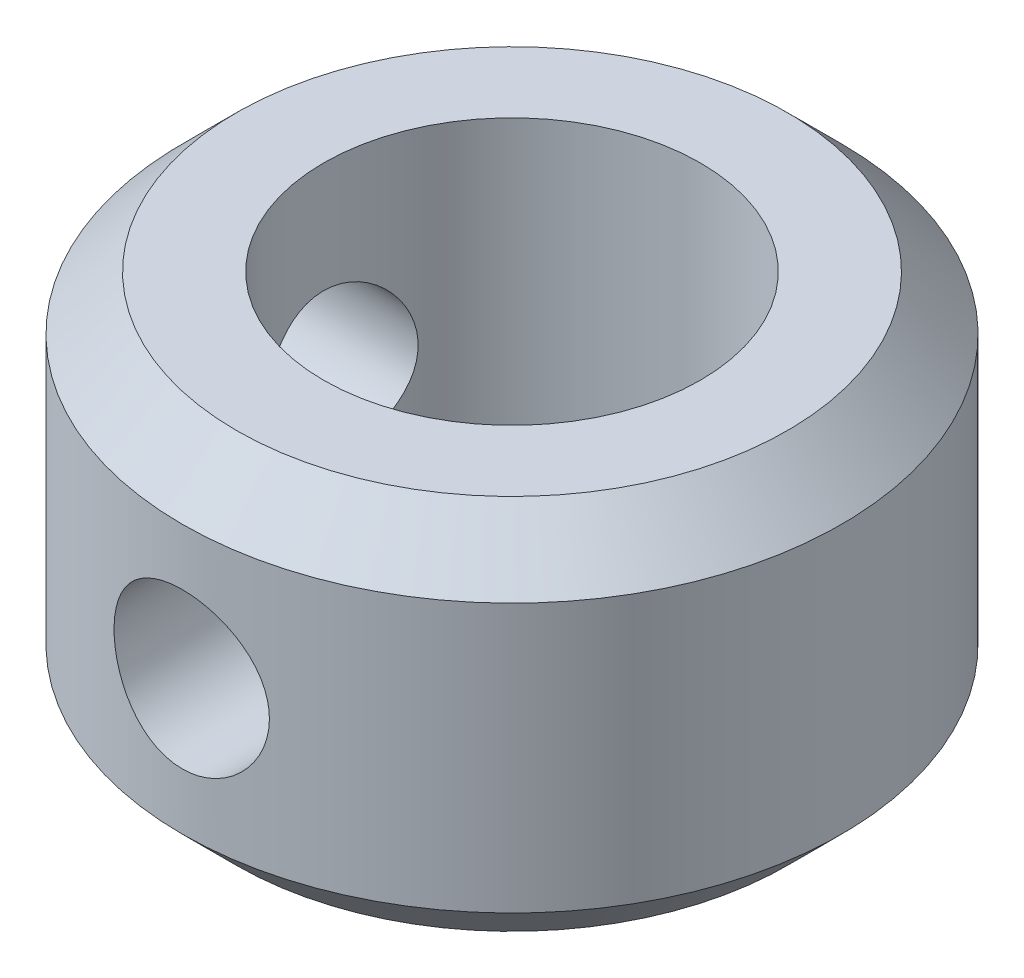
ISO-10303-21;
HEADER;
FILE_DESCRIPTION(('STEP AP214'),'2;1');
FILE_NAME('part.step','',(''),(''),'','','');
FILE_SCHEMA(('AUTOMOTIVE_DESIGN { 1 0 10303 214 1 1 1 1 }'));
ENDSEC;
DATA;
#1=APPLICATION_CONTEXT('core data for automotive mechanical design processes');
#2=APPLICATION_PROTOCOL_DEFINITION('international standard','automotive_design',2000,#1);
#3=PRODUCT_CONTEXT('',#1,'mechanical');
#4=PRODUCT('Part','Part','',(#3));
#5=PRODUCT_RELATED_PRODUCT_CATEGORY('part','',(#4));
#6=PRODUCT_DEFINITION_FORMATION('','',#4);
#7=PRODUCT_DEFINITION_CONTEXT('part definition',#1,'design');
#8=PRODUCT_DEFINITION('design','',#6,#7);
#9=PRODUCT_DEFINITION_SHAPE('','',#8);
#10=(LENGTH_UNIT() NAMED_UNIT(*) SI_UNIT(.MILLI.,.METRE.));
#11=(NAMED_UNIT(*) PLANE_ANGLE_UNIT() SI_UNIT($,.RADIAN.));
#12=(NAMED_UNIT(*) SI_UNIT($,.STERADIAN.) SOLID_ANGLE_UNIT());
#13=UNCERTAINTY_MEASURE_WITH_UNIT(LENGTH_MEASURE(1.E-05),#10,'distance_accuracy_value','');
#14=(GEOMETRIC_REPRESENTATION_CONTEXT(3) GLOBAL_UNCERTAINTY_ASSIGNED_CONTEXT((#13)) GLOBAL_UNIT_ASSIGNED_CONTEXT((#10,
#11,#12)) REPRESENTATION_CONTEXT('',''));
#15=CARTESIAN_POINT('',(0.,0.,0.));
#16=DIRECTION('',(0.,0.,1.));
#17=DIRECTION('',(1.,0.,0.));
#18=AXIS2_PLACEMENT_3D('',#15,#16,#17);
#19=CARTESIAN_POINT('',(0.,4.,0.));
#20=DIRECTION('',(0.,1.,0.));
#21=DIRECTION('',(0.,0.,1.));
#22=AXIS2_PLACEMENT_3D('',#19,#20,#21);
#23=PLANE('',#22);
#24=CARTESIAN_POINT('',(0.,4.,0.));
#25=DIRECTION('',(0.,1.,0.));
#26=DIRECTION('',(0.,0.,1.));
#27=AXIS2_PLACEMENT_3D('',#24,#25,#26);
#28=CIRCLE('',#27,5.85);
#29=CARTESIAN_POINT('',(0.,4.,5.85));
#30=VERTEX_POINT('',#29);
#31=EDGE_CURVE('E10',#30,#30,#28,.T.);
#32=ORIENTED_EDGE('',*,*,#31,.T.);
#33=EDGE_LOOP('',(#32));
#34=FACE_BOUND('',#33,.T.);
#35=CARTESIAN_POINT('',(0.,4.,0.));
#36=DIRECTION('',(0.,1.,0.));
#37=DIRECTION('',(0.,0.,1.));
#38=AXIS2_PLACEMENT_3D('',#35,#36,#37);
#39=CIRCLE('',#38,4.);
#40=CARTESIAN_POINT('',(0.,4.,4.));
#41=VERTEX_POINT('',#40);
#42=EDGE_CURVE('E68',#41,#41,#39,.T.);
#43=ORIENTED_EDGE('',*,*,#42,.F.);
#44=EDGE_LOOP('',(#43));
#45=FACE_BOUND('',#44,.T.);
#46=ADVANCED_FACE('F47',(#34,#45),#23,.T.);
#47=CARTESIAN_POINT('',(0.,-4.,0.));
#48=DIRECTION('',(0.,1.,0.));
#49=DIRECTION('',(0.,0.,1.));
#50=AXIS2_PLACEMENT_3D('',#47,#48,#49);
#51=PLANE('',#50);
#52=CARTESIAN_POINT('',(0.,-4.,0.));
#53=DIRECTION('',(0.,1.,0.));
#54=DIRECTION('',(0.,0.,1.));
#55=AXIS2_PLACEMENT_3D('',#52,#53,#54);
#56=CIRCLE('',#55,5.84999999999999);
#57=CARTESIAN_POINT('',(0.,-4.,5.84999999999999));
#58=VERTEX_POINT('',#57);
#59=EDGE_CURVE('E55',#58,#58,#56,.F.);
#60=ORIENTED_EDGE('',*,*,#59,.T.);
#61=EDGE_LOOP('',(#60));
#62=FACE_BOUND('',#61,.T.);
#63=CARTESIAN_POINT('',(0.,-4.,0.));
#64=DIRECTION('',(0.,1.,0.));
#65=DIRECTION('',(0.,0.,1.));
#66=AXIS2_PLACEMENT_3D('',#63,#64,#65);
#67=CIRCLE('',#66,4.);
#68=CARTESIAN_POINT('',(0.,-4.,4.));
#69=VERTEX_POINT('',#68);
#70=EDGE_CURVE('E69',#69,#69,#67,.T.);
#71=ORIENTED_EDGE('',*,*,#70,.T.);
#72=EDGE_LOOP('',(#71));
#73=FACE_BOUND('',#72,.T.);
#74=ADVANCED_FACE('F107',(#62,#73),#51,.F.);
#75=CARTESIAN_POINT('',(0.,4.,0.));
#76=DIRECTION('',(0.,-1.,0.));
#77=DIRECTION('',(0.,0.,-1.));
#78=AXIS2_PLACEMENT_3D('',#75,#76,#77);
#79=CYLINDRICAL_SURFACE('',#78,7.);
#80=CARTESIAN_POINT('',(-6.80275679412399,0.,1.64999999999998));
#81=CARTESIAN_POINT('',(-6.80275861136206,-0.0912890000234779,1.64999713007314));
#82=CARTESIAN_POINT('',(-6.80461440498174,-0.182610998381094,1.64239813439993));
#83=CARTESIAN_POINT('',(-6.81182064992734,-0.362644563434028,1.61224414767595));
#84=CARTESIAN_POINT('',(-6.81717336620826,-0.451354399288549,1.58967946321203));
#85=CARTESIAN_POINT('',(-6.83073431325552,-0.623533512523368,1.53035515036091));
#86=CARTESIAN_POINT('',(-6.83893911932178,-0.707008933959494,1.49361254058447));
#87=CARTESIAN_POINT('',(-6.85727558075245,-0.866616532790047,1.40702581854955));
#88=CARTESIAN_POINT('',(-6.86740726130098,-0.942748614187931,1.35718153504988));
#89=CARTESIAN_POINT('',(-6.88867782513988,-1.08699982868594,1.24476461908349));
#90=CARTESIAN_POINT('',(-6.89983131541128,-1.15495404527719,1.18198309355865));
#91=CARTESIAN_POINT('',(-6.92176152937785,-1.27947171170117,1.04592427298926));
#92=CARTESIAN_POINT('',(-6.93253822068664,-1.33603418437752,0.972646078487472));
#93=CARTESIAN_POINT('',(-6.95266103704035,-1.43682696981727,0.816555491676971));
#94=CARTESIAN_POINT('',(-6.96198791366554,-1.48089686123284,0.73363681447964));
#95=CARTESIAN_POINT('',(-6.97799434603916,-1.55441290827776,0.561312838562611));
#96=CARTESIAN_POINT('',(-6.98467424785277,-1.58386097569016,0.471908389601348));
#97=CARTESIAN_POINT('',(-6.99453084372035,-1.62677370217112,0.29086802205239));
#98=CARTESIAN_POINT('',(-6.99776875317269,-1.64051799396695,0.199301775715435));
#99=CARTESIAN_POINT('',(-7.00058928212562,-1.65250913676126,0.015109783907853));
#100=CARTESIAN_POINT('',(-7.00017238432294,-1.65075803426303,-0.0775158200378599));
#101=CARTESIAN_POINT('',(-6.99577641572093,-1.63201259498984,-0.259263367840057));
#102=CARTESIAN_POINT('',(-6.99186783471482,-1.61531988499546,-0.348418380319093));
#103=CARTESIAN_POINT('',(-6.98100889430398,-1.56764792556426,-0.522624624983785));
#104=CARTESIAN_POINT('',(-6.97405838372646,-1.53666796609913,-0.607675652983124));
#105=CARTESIAN_POINT('',(-6.95778608866946,-1.46104622960672,-0.772074386794576));
#106=CARTESIAN_POINT('',(-6.94844521053821,-1.41629382953033,-0.851369239725069));
#107=CARTESIAN_POINT('',(-6.92841069918987,-1.31448077411501,-1.00143136070303));
#108=CARTESIAN_POINT('',(-6.91771685448099,-1.25741819349895,-1.07219729215005));
#109=CARTESIAN_POINT('',(-6.89584251761334,-1.13097547490599,-1.20498965605835));
#110=CARTESIAN_POINT('',(-6.88465650871199,-1.06133150430551,-1.26676421005728));
#111=CARTESIAN_POINT('',(-6.8632971795881,-0.912555678850197,-1.37780936391996));
#112=CARTESIAN_POINT('',(-6.85312389657327,-0.83342347563159,-1.42707950447268));
#113=CARTESIAN_POINT('',(-6.83492437266262,-0.667464740192945,-1.51185477157776));
#114=CARTESIAN_POINT('',(-6.82690665922474,-0.580609406049146,-1.54730546989211));
#115=CARTESIAN_POINT('',(-6.8140390867396,-0.40193872243084,-1.60302771512783));
#116=CARTESIAN_POINT('',(-6.80918863409246,-0.31012430586923,-1.62330210645791));
#117=CARTESIAN_POINT('',(-6.80332774943588,-0.12646144305076,-1.64769127898041));
#118=CARTESIAN_POINT('',(-6.80222947433875,-0.0346648402699374,-1.65217579860459));
#119=CARTESIAN_POINT('',(-6.80375919481422,0.148364576583741,-1.64586488795027));
#120=CARTESIAN_POINT('',(-6.80638688917232,0.239597435631894,-1.63507069283236));
#121=CARTESIAN_POINT('',(-6.81498886694796,0.417577450747468,-1.59883140460814));
#122=CARTESIAN_POINT('',(-6.82091521063604,0.504369845653747,-1.5735960425171));
#123=CARTESIAN_POINT('',(-6.83540229380027,0.672493686634514,-1.50942069873875));
#124=CARTESIAN_POINT('',(-6.84396331787599,0.753824541593779,-1.47047923644587));
#125=CARTESIAN_POINT('',(-6.86294389007105,0.910299056589382,-1.37920410959567));
#126=CARTESIAN_POINT('',(-6.87339357272798,0.985308184742531,-1.32664621508519));
#127=CARTESIAN_POINT('',(-6.89489755256542,1.12557800629822,-1.20991829013256));
#128=CARTESIAN_POINT('',(-6.90595193742742,1.19083728083161,-1.14574657256201));
#129=CARTESIAN_POINT('',(-6.92771364919943,1.31122298204255,-1.00592681617984));
#130=CARTESIAN_POINT('',(-6.93840801965821,1.36609535547159,-0.930057660220554));
#131=CARTESIAN_POINT('',(-6.95799159344944,1.46231801677791,-0.769965220758971));
#132=CARTESIAN_POINT('',(-6.96688088727282,1.50366898256505,-0.685742356354583));
#133=CARTESIAN_POINT('',(-6.98179887024889,1.57133783893331,-0.511894272134583));
#134=CARTESIAN_POINT('',(-6.98784709878863,1.59775867456761,-0.422310877248057));
#135=CARTESIAN_POINT('',(-6.99648655479454,1.63513286894146,-0.239816201973873));
#136=CARTESIAN_POINT('',(-6.99907837091255,1.64608886147333,-0.146905491020391));
#137=CARTESIAN_POINT('',(-7.00049202890772,1.65208813057133,0.0372082467747126));
#138=CARTESIAN_POINT('',(-6.9994031706394,1.64750832426096,0.128398504210663));
#139=CARTESIAN_POINT('',(-6.99377268350157,1.62341975270527,0.308670729816493));
#140=CARTESIAN_POINT('',(-6.98923113721447,1.60391134452658,0.397752748359306));
#141=CARTESIAN_POINT('',(-6.97721604451342,1.55071176108928,0.570933576895618));
#142=CARTESIAN_POINT('',(-6.96975517685192,1.51708187051132,0.655052149359122));
#143=CARTESIAN_POINT('',(-6.95269208722048,1.4366509910792,0.816498795364736));
#144=CARTESIAN_POINT('',(-6.94308962308136,1.38984851252764,0.893826099578973));
#145=CARTESIAN_POINT('',(-6.92252474173611,1.28321390355334,1.0413072599721));
#146=CARTESIAN_POINT('',(-6.91153737485731,1.22312153020512,1.11126948147332));
#147=CARTESIAN_POINT('',(-6.88956325338245,1.09212760248887,1.24024523339419));
#148=CARTESIAN_POINT('',(-6.8785764996075,1.02122338274089,1.29925605605593));
#149=CARTESIAN_POINT('',(-6.85764827463158,0.869245406144731,1.40557849643648));
#150=CARTESIAN_POINT('',(-6.84772646444862,0.788026388521302,1.4526866153972));
#151=CARTESIAN_POINT('',(-6.83030721412674,0.618602666246867,1.53250931126196));
#152=CARTESIAN_POINT('',(-6.8228078728753,0.530403507505555,1.56523518241756));
#153=CARTESIAN_POINT('',(-6.81235745600282,0.368530845590517,1.61002842680634));
#154=CARTESIAN_POINT('',(-6.80878274857868,0.295683995155681,1.62498700416514));
#155=CARTESIAN_POINT('',(-6.80398175593831,0.148565318467718,1.64497362976396));
#156=CARTESIAN_POINT('',(-6.80275531520392,0.0742935869089511,1.65000233562813));
#157=CARTESIAN_POINT('',(-6.80275679412399,0.,1.64999999999998));
#158=B_SPLINE_CURVE_WITH_KNOTS('',3,(#80,#81,#82,#83,#84,#85,#86,#87,#88,#89,#90,#91,#92,#93,
#94,#95,#96,#97,#98,#99,#100,#101,#102,#103,#104,#105,#106,#107,#108,#109,#110,#111,#112,#113,
#114,#115,#116,#117,#118,#119,#120,#121,#122,#123,#124,#125,#126,#127,#128,#129,#130,#131,#132,
#133,#134,#135,#136,#137,#138,#139,#140,#141,#142,#143,#144,#145,#146,#147,#148,#149,#150,#151,
#152,#153,#154,#155,#156,#157),.UNSPECIFIED.,.T.,.F.,(4,2,2,2,2,2,2,2,2,2,2,2,2,2,2,2,2,2,2,2,2,
2,2,2,2,2,2,2,2,2,2,2,2,2,2,2,2,2,4),(0.,0.273594440399258,0.547366263700774,0.820810479503744,
1.0942582694491,1.37252656286893,1.65081871531698,1.93253747960749,2.21421939985748,
2.49080324523182,2.76735056224876,3.03843805884697,3.30953902903524,3.5828770280852,
3.85625780745004,4.13623055025586,4.41621357550839,4.69728844125184,4.97831061353603,
5.25270687968443,5.52708096437946,5.79756789407088,6.06808405216623,6.34337456664896,
6.61870510445458,6.90008328124663,7.18144734868653,7.46084693391317,7.74019892930651,
8.01282246332762,8.28543947686365,8.55688541369867,8.82836206089266,9.10571835709369,
9.38314313916058,9.66503130549495,9.9466977102697,10.1693714016501,10.3920303455577),.UNSPECIFIED.);
#159=CARTESIAN_POINT('',(-6.80275679412399,0.,1.64999999999998));
#160=VERTEX_POINT('',#159);
#161=EDGE_CURVE('E123',#160,#160,#158,.T.);
#162=ORIENTED_EDGE('',*,*,#161,.T.);
#163=EDGE_LOOP('',(#162));
#164=FACE_BOUND('',#163,.T.);
#165=CARTESIAN_POINT('',(0.,-2.85,0.));
#166=DIRECTION('',(0.,1.,0.));
#167=DIRECTION('',(0.,0.,1.));
#168=AXIS2_PLACEMENT_3D('',#165,#166,#167);
#169=CIRCLE('',#168,7.);
#170=CARTESIAN_POINT('',(0.,-2.85,7.));
#171=VERTEX_POINT('',#170);
#172=EDGE_CURVE('E59',#171,#171,#169,.T.);
#173=ORIENTED_EDGE('',*,*,#172,.T.);
#174=EDGE_LOOP('',(#173));
#175=FACE_BOUND('',#174,.T.);
#176=CARTESIAN_POINT('',(0.,2.85,0.));
#177=DIRECTION('',(0.,1.,0.));
#178=DIRECTION('',(0.,0.,1.));
#179=AXIS2_PLACEMENT_3D('',#176,#177,#178);
#180=CIRCLE('',#179,7.);
#181=CARTESIAN_POINT('',(0.,2.85,7.));
#182=VERTEX_POINT('',#181);
#183=EDGE_CURVE('E63',#182,#182,#180,.F.);
#184=ORIENTED_EDGE('',*,*,#183,.T.);
#185=EDGE_LOOP('',(#184));
#186=FACE_BOUND('',#185,.T.);
#187=CARTESIAN_POINT('',(1.65,0.,6.80275679412398));
#188=CARTESIAN_POINT('',(1.64999713007316,-0.0912890000234778,6.80275861136205));
#189=CARTESIAN_POINT('',(1.64239813439995,-0.182610998381094,6.80461440498174));
#190=CARTESIAN_POINT('',(1.61224414767597,-0.362644563434028,6.81182064992733));
#191=CARTESIAN_POINT('',(1.58967946321205,-0.451354399288548,6.81717336620826));
#192=CARTESIAN_POINT('',(1.53035515036094,-0.623533512523368,6.83073431325551));
#193=CARTESIAN_POINT('',(1.49361254058449,-0.707008933959494,6.83893911932177));
#194=CARTESIAN_POINT('',(1.40702581854958,-0.866616532790047,6.85727558075245));
#195=CARTESIAN_POINT('',(1.3571815350499,-0.94274861418793,6.86740726130097));
#196=CARTESIAN_POINT('',(1.24476461908352,-1.08699982868594,6.88867782513987));
#197=CARTESIAN_POINT('',(1.18198309355868,-1.15495404527719,6.89983131541127));
#198=CARTESIAN_POINT('',(1.04592427298928,-1.27947171170116,6.92176152937784));
#199=CARTESIAN_POINT('',(0.972646078487497,-1.33603418437752,6.93253822068664));
#200=CARTESIAN_POINT('',(0.816555491676995,-1.43682696981727,6.95266103704034));
#201=CARTESIAN_POINT('',(0.733636814479665,-1.48089686123284,6.96198791366554));
#202=CARTESIAN_POINT('',(0.561312838562636,-1.55441290827776,6.97799434603916));
#203=CARTESIAN_POINT('',(0.471908389601373,-1.58386097569016,6.98467424785277));
#204=CARTESIAN_POINT('',(0.290868022052415,-1.62677370217112,6.99453084372035));
#205=CARTESIAN_POINT('',(0.199301775715461,-1.64051799396695,6.99776875317269));
#206=CARTESIAN_POINT('',(0.0151097839078784,-1.65250913676126,7.00058928212562));
#207=CARTESIAN_POINT('',(-0.0775158200378344,-1.65075803426303,7.00017238432294));
#208=CARTESIAN_POINT('',(-0.259263367840032,-1.63201259498984,6.99577641572093));
#209=CARTESIAN_POINT('',(-0.348418380319068,-1.61531988499546,6.99186783471482));
#210=CARTESIAN_POINT('',(-0.52262462498376,-1.56764792556427,6.98100889430398));
#211=CARTESIAN_POINT('',(-0.607675652983099,-1.53666796609913,6.97405838372646));
#212=CARTESIAN_POINT('',(-0.77207438679455,-1.46104622960672,6.95778608866946));
#213=CARTESIAN_POINT('',(-0.851369239725044,-1.41629382953033,6.94844521053821));
#214=CARTESIAN_POINT('',(-1.00143136070301,-1.31448077411501,6.92841069918987));
#215=CARTESIAN_POINT('',(-1.07219729215003,-1.25741819349895,6.91771685448099));
#216=CARTESIAN_POINT('',(-1.20498965605832,-1.13097547490599,6.89584251761335));
#217=CARTESIAN_POINT('',(-1.26676421005725,-1.06133150430551,6.88465650871199));
#218=CARTESIAN_POINT('',(-1.37780936391993,-0.912555678850199,6.8632971795881));
#219=CARTESIAN_POINT('',(-1.42707950447265,-0.833423475631591,6.85312389657327));
#220=CARTESIAN_POINT('',(-1.51185477157774,-0.667464740192947,6.83492437266263));
#221=CARTESIAN_POINT('',(-1.54730546989208,-0.580609406049148,6.82690665922475));
#222=CARTESIAN_POINT('',(-1.6030277151278,-0.401938722430842,6.8140390867396));
#223=CARTESIAN_POINT('',(-1.62330210645788,-0.310124305869232,6.80918863409247));
#224=CARTESIAN_POINT('',(-1.64769127898038,-0.126461443050763,6.80332774943589));
#225=CARTESIAN_POINT('',(-1.65217579860456,-0.0346648402699397,6.80222947433876));
#226=CARTESIAN_POINT('',(-1.64586488795024,0.148364576583739,6.80375919481422));
#227=CARTESIAN_POINT('',(-1.63507069283233,0.239597435631891,6.80638688917233));
#228=CARTESIAN_POINT('',(-1.59883140460811,0.417577450747466,6.81498886694796));
#229=CARTESIAN_POINT('',(-1.57359604251707,0.504369845653746,6.82091521063605));
#230=CARTESIAN_POINT('',(-1.50942069873872,0.672493686634512,6.83540229380027));
#231=CARTESIAN_POINT('',(-1.47047923644584,0.753824541593777,6.84396331787599));
#232=CARTESIAN_POINT('',(-1.37920410959564,0.91029905658938,6.86294389007106));
#233=CARTESIAN_POINT('',(-1.32664621508517,0.98530818474253,6.87339357272798));
#234=CARTESIAN_POINT('',(-1.20991829013253,1.12557800629822,6.89489755256543));
#235=CARTESIAN_POINT('',(-1.14574657256199,1.19083728083161,6.90595193742742));
#236=CARTESIAN_POINT('',(-1.00592681617982,1.31122298204255,6.92771364919943));
#237=CARTESIAN_POINT('',(-0.930057660220531,1.36609535547159,6.93840801965821));
#238=CARTESIAN_POINT('',(-0.769965220758949,1.4623180167779,6.95799159344945));
#239=CARTESIAN_POINT('',(-0.68574235635456,1.50366898256505,6.96688088727282));
#240=CARTESIAN_POINT('',(-0.511894272134561,1.57133783893331,6.98179887024889));
#241=CARTESIAN_POINT('',(-0.422310877248035,1.59775867456761,6.98784709878863));
#242=CARTESIAN_POINT('',(-0.239816201973852,1.63513286894146,6.99648655479454));
#243=CARTESIAN_POINT('',(-0.146905491020369,1.64608886147333,6.99907837091255));
#244=CARTESIAN_POINT('',(0.0372082467747346,1.65208813057133,7.00049202890772));
#245=CARTESIAN_POINT('',(0.128398504210685,1.64750832426096,6.9994031706394));
#246=CARTESIAN_POINT('',(0.308670729816515,1.62341975270527,6.99377268350157));
#247=CARTESIAN_POINT('',(0.397752748359328,1.60391134452658,6.98923113721447));
#248=CARTESIAN_POINT('',(0.57093357689564,1.55071176108928,6.97721604451341));
#249=CARTESIAN_POINT('',(0.655052149359144,1.51708187051132,6.96975517685192));
#250=CARTESIAN_POINT('',(0.816498795364758,1.4366509910792,6.95269208722048));
#251=CARTESIAN_POINT('',(0.893826099578996,1.38984851252764,6.94308962308136));
#252=CARTESIAN_POINT('',(1.04130725997212,1.28321390355334,6.92252474173611));
#253=CARTESIAN_POINT('',(1.11126948147334,1.22312153020512,6.91153737485731));
#254=CARTESIAN_POINT('',(1.24024523339421,1.09212760248887,6.88956325338245));
#255=CARTESIAN_POINT('',(1.29925605605595,1.02122338274089,6.87857649960749));
#256=CARTESIAN_POINT('',(1.40557849643651,0.869245406144734,6.85764827463158));
#257=CARTESIAN_POINT('',(1.45268661539722,0.788026388521305,6.84772646444862));
#258=CARTESIAN_POINT('',(1.53250931126199,0.61860266624687,6.83030721412674));
#259=CARTESIAN_POINT('',(1.56523518241758,0.530403507505558,6.82280787287529));
#260=CARTESIAN_POINT('',(1.61002842680637,0.36853084559052,6.81235745600281));
#261=CARTESIAN_POINT('',(1.62498700416516,0.295683995155683,6.80878274857867));
#262=CARTESIAN_POINT('',(1.64497362976398,0.148565318467719,6.8039817559383));
#263=CARTESIAN_POINT('',(1.65000233562816,0.0742935869089515,6.80275531520391));
#264=CARTESIAN_POINT('',(1.65,0.,6.80275679412398));
#265=B_SPLINE_CURVE_WITH_KNOTS('',3,(#187,#188,#189,#190,#191,#192,#193,#194,#195,#196,#197,
#198,#199,#200,#201,#202,#203,#204,#205,#206,#207,#208,#209,#210,#211,#212,#213,#214,#215,#216,
#217,#218,#219,#220,#221,#222,#223,#224,#225,#226,#227,#228,#229,#230,#231,#232,#233,#234,#235,
#236,#237,#238,#239,#240,#241,#242,#243,#244,#245,#246,#247,#248,#249,#250,#251,#252,#253,#254,
#255,#256,#257,#258,#259,#260,#261,#262,#263,#264),.UNSPECIFIED.,.T.,.F.,(4,2,2,2,2,2,2,2,2,2,2,
2,2,2,2,2,2,2,2,2,2,2,2,2,2,2,2,2,2,2,2,2,2,2,2,2,2,2,4),(0.,0.273594440399257,
0.547366263700773,0.820810479503744,1.0942582694491,1.37252656286893,1.65081871531698,
1.93253747960749,2.21421939985748,2.49080324523182,2.76735056224876,3.03843805884696,
3.30953902903524,3.5828770280852,3.85625780745004,4.13623055025586,4.41621357550839,
4.69728844125184,4.97831061353603,5.25270687968443,5.52708096437946,5.79756789407088,
6.06808405216623,6.34337456664896,6.61870510445458,6.90008328124663,7.18144734868653,
7.46084693391317,7.74019892930651,8.01282246332762,8.28543947686366,8.55688541369867,
8.82836206089266,9.10571835709369,9.38314313916058,9.66503130549495,9.9466977102697,
10.1693714016501,10.3920303455577),.UNSPECIFIED.);
#266=CARTESIAN_POINT('',(1.65,0.,6.80275679412398));
#267=VERTEX_POINT('',#266);
#268=EDGE_CURVE('E72',#267,#267,#265,.T.);
#269=ORIENTED_EDGE('',*,*,#268,.T.);
#270=EDGE_LOOP('',(#269));
#271=FACE_BOUND('',#270,.T.);
#272=ADVANCED_FACE('F88',(#164,#175,#186,#271),#79,.T.);
#273=CARTESIAN_POINT('',(0.,4.,0.));
#274=DIRECTION('',(0.,-1.,0.));
#275=DIRECTION('',(0.,0.,-1.));
#276=AXIS2_PLACEMENT_3D('',#273,#274,#275);
#277=CYLINDRICAL_SURFACE('',#276,4.);
#278=CARTESIAN_POINT('',(-3.64383040220042,0.,1.64999999999999));
#279=CARTESIAN_POINT('',(-3.64383945275153,-0.0880964802256836,1.64999056813101));
#280=CARTESIAN_POINT('',(-3.64707173267574,-0.176340431973594,1.64289989177357));
#281=CARTESIAN_POINT('',(-3.65959209124688,-0.35028706107888,1.61480845546372));
#282=CARTESIAN_POINT('',(-3.66889676295875,-0.435982100597603,1.59376957896339));
#283=CARTESIAN_POINT('',(-3.69231325052126,-0.602002938130633,1.53873536249637));
#284=CARTESIAN_POINT('',(-3.70640571161012,-0.682348820218598,1.50479212400172));
#285=CARTESIAN_POINT('',(-3.73778230052357,-0.836181766834224,1.42506535594205));
#286=CARTESIAN_POINT('',(-3.75506562873473,-0.909670542784035,1.37928479159594));
#287=CARTESIAN_POINT('',(-3.79205530418551,-1.0522286878465,1.2741985629037));
#288=CARTESIAN_POINT('',(-3.8118427770478,-1.12082925578021,1.21428518241358));
#289=CARTESIAN_POINT('',(-3.85094363418238,-1.24735477190876,1.08391072165481));
#290=CARTESIAN_POINT('',(-3.87025683535297,-1.30527565147222,1.01344563996363));
#291=CARTESIAN_POINT('',(-3.90721575035943,-1.41117137130186,0.860301943593368));
#292=CARTESIAN_POINT('',(-3.92475616703248,-1.45862093270616,0.777232390113576));
#293=CARTESIAN_POINT('',(-3.95520283117798,-1.5386701453217,0.603436361875843));
#294=CARTESIAN_POINT('',(-3.96811109652272,-1.57127626434656,0.512713242513031));
#295=CARTESIAN_POINT('',(-3.98726403378776,-1.61902070665623,0.331105172304384));
#296=CARTESIAN_POINT('',(-3.99381564337609,-1.63496684792323,0.240465625184478));
#297=CARTESIAN_POINT('',(-4.0006306156112,-1.65154665185517,0.0575763551498512));
#298=CARTESIAN_POINT('',(-4.00089647540932,-1.65218639532201,-0.0346727137709691));
#299=CARTESIAN_POINT('',(-3.99529224160632,-1.63856350386341,-0.212297380895999));
#300=CARTESIAN_POINT('',(-3.98978733384658,-1.6251878162829,-0.297754665400411));
#301=CARTESIAN_POINT('',(-3.97375926025944,-1.58543118255224,-0.465085845235293));
#302=CARTESIAN_POINT('',(-3.96323572489496,-1.55904927870932,-0.546959476205506));
#303=CARTESIAN_POINT('',(-3.93798907731602,-1.49371233827982,-0.706295606817243));
#304=CARTESIAN_POINT('',(-3.92320447216362,-1.45457201007513,-0.783671979762483));
#305=CARTESIAN_POINT('',(-3.89088763760773,-1.3650087208134,-0.930960489992479));
#306=CARTESIAN_POINT('',(-3.87335444442336,-1.3145817994967,-1.00086999453933));
#307=CARTESIAN_POINT('',(-3.83587133640027,-1.19981176097137,-1.13638530947042));
#308=CARTESIAN_POINT('',(-3.8158381454309,-1.13474658910128,-1.20135746318646));
#309=CARTESIAN_POINT('',(-3.77653142784555,-0.994590333678428,-1.31973838423495));
#310=CARTESIAN_POINT('',(-3.75725818494772,-0.919495550736701,-1.37314286572203));
#311=CARTESIAN_POINT('',(-3.72106607156909,-0.758401596452687,-1.46845339844829));
#312=CARTESIAN_POINT('',(-3.70424107982557,-0.672132428307352,-1.50994179309278));
#313=CARTESIAN_POINT('',(-3.67596385006485,-0.492953328594107,-1.57754508127097));
#314=CARTESIAN_POINT('',(-3.66450786071417,-0.400048086126187,-1.60367071206122));
#315=CARTESIAN_POINT('',(-3.64919091711418,-0.216577104815017,-1.63821320355943));
#316=CARTESIAN_POINT('',(-3.64489111171831,-0.126241698817143,-1.64765569454683));
#317=CARTESIAN_POINT('',(-3.64311980380967,0.0548056296985959,-1.65157101672828));
#318=CARTESIAN_POINT('',(-3.64564601607449,0.145517416059281,-1.64604885780403));
#319=CARTESIAN_POINT('',(-3.6567894436616,0.31880100904947,-1.62112710501828));
#320=CARTESIAN_POINT('',(-3.66501803861664,0.401528179674606,-1.60261202118544));
#321=CARTESIAN_POINT('',(-3.68614612916707,0.56263706437997,-1.55339580262016));
#322=CARTESIAN_POINT('',(-3.69904670212356,0.641017771351657,-1.52269185697124));
#323=CARTESIAN_POINT('',(-3.72872477858182,0.794879005695636,-1.44853902204986));
#324=CARTESIAN_POINT('',(-3.74564214050945,0.870100194779244,-1.40460979308265));
#325=CARTESIAN_POINT('',(-3.78124523189863,1.01246016942973,-1.30573455409453));
#326=CARTESIAN_POINT('',(-3.79993171387674,1.07959548773512,-1.25078384473685));
#327=CARTESIAN_POINT('',(-3.83876011670653,1.20942962644671,-1.126275421621));
#328=CARTESIAN_POINT('',(-3.85889967217622,1.27135173704872,-1.05590387126705));
#329=CARTESIAN_POINT('',(-3.89698114804694,1.38264285566206,-0.905297980080119));
#330=CARTESIAN_POINT('',(-3.91492292631236,1.4320110520032,-0.825063002026919));
#331=CARTESIAN_POINT('',(-3.94668767391886,1.51670413420679,-0.656516816883283));
#332=CARTESIAN_POINT('',(-3.96050313975063,1.55200347500273,-0.568191273870507));
#333=CARTESIAN_POINT('',(-3.98237104121021,1.60699165685874,-0.386140833605193));
#334=CARTESIAN_POINT('',(-3.9904268305481,1.62668958293894,-0.292419112817577));
#335=CARTESIAN_POINT('',(-3.9994889299446,1.64878822892048,-0.109187189544852));
#336=CARTESIAN_POINT('',(-4.00094173424749,1.65228482874194,-0.0198303081186516));
#337=CARTESIAN_POINT('',(-3.99786220239439,1.64481456562972,0.158161739195396));
#338=CARTESIAN_POINT('',(-3.99333087896147,1.63385015000455,0.246797024648464));
#339=CARTESIAN_POINT('',(-3.979024148364,1.59855535786444,0.41770537593586));
#340=CARTESIAN_POINT('',(-3.96943363922013,1.57469555788545,0.500092371627836));
#341=CARTESIAN_POINT('',(-3.94605480923816,1.51479588512001,0.659667355734144));
#342=CARTESIAN_POINT('',(-3.93226568297163,1.47875367521332,0.736854343148728));
#343=CARTESIAN_POINT('',(-3.9010580848376,1.39369547331361,0.887661133732603));
#344=CARTESIAN_POINT('',(-3.8835042391169,1.34416874322707,0.960964214361134));
#345=CARTESIAN_POINT('',(-3.84685709666619,1.23429715321,1.09852932170703));
#346=CARTESIAN_POINT('',(-3.82776324400833,1.17394837691919,1.16278806031648));
#347=CARTESIAN_POINT('',(-3.78859741195738,1.03941247264534,1.28487769945045));
#348=CARTESIAN_POINT('',(-3.76854475207572,0.964572243115063,1.34199767947155));
#349=CARTESIAN_POINT('',(-3.73105419200534,0.805734024318935,1.44296474677329));
#350=CARTESIAN_POINT('',(-3.7136177396712,0.721731008290412,1.48680449811902));
#351=CARTESIAN_POINT('',(-3.68370387904714,0.547271558730106,1.5594444776665));
#352=CARTESIAN_POINT('',(-3.67119480418034,0.456860891908904,1.58834112875232));
#353=CARTESIAN_POINT('',(-3.65281837075147,0.271952855921642,1.63017263567571));
#354=CARTESIAN_POINT('',(-3.64692873900432,0.17747030912313,1.64316103312973));
#355=CARTESIAN_POINT('',(-3.6441405441978,0.0551366863573563,1.64931209329419));
#356=CARTESIAN_POINT('',(-3.64382756923723,0.0275755677149826,1.65000295232159));
#357=CARTESIAN_POINT('',(-3.64383040220042,0.,1.64999999999999));
#358=B_SPLINE_CURVE_WITH_KNOTS('',3,(#278,#279,#280,#281,#282,#283,#284,#285,#286,#287,#288,
#289,#290,#291,#292,#293,#294,#295,#296,#297,#298,#299,#300,#301,#302,#303,#304,#305,#306,#307,
#308,#309,#310,#311,#312,#313,#314,#315,#316,#317,#318,#319,#320,#321,#322,#323,#324,#325,#326,
#327,#328,#329,#330,#331,#332,#333,#334,#335,#336,#337,#338,#339,#340,#341,#342,#343,#344,#345,
#346,#347,#348,#349,#350,#351,#352,#353,#354,#355,#356,#357),.UNSPECIFIED.,.T.,.F.,(4,2,2,2,2,2,
2,2,2,2,2,2,2,2,2,2,2,2,2,2,2,2,2,2,2,2,2,2,2,2,2,2,2,2,2,2,2,2,2,4),(0.,0.264211724660744,
0.529148459018597,0.793026677872048,1.05683885985756,1.33523297260792,1.61373292676209,
1.90403076094908,2.19420198072699,2.4695381624427,2.74476495901024,3.00356896819766,
3.26239203686791,3.5251552692474,3.78801084539545,4.06907613148064,4.35024537535724,
4.64031806272423,4.9301877724111,5.20152035698263,5.47276211576042,5.72713321026166,
5.9815630002888,6.24665916965708,6.51186861189123,6.79815687284346,7.08446363898863,
7.3712879145617,7.6579450434915,7.92489841526079,8.19180661499934,8.44957452423759,
8.70739191275387,8.97680852354694,9.24632283025306,9.53374725602175,9.82133016535515,
10.1070334851925,10.3917725616094,10.4744749384332),.UNSPECIFIED.);
#359=CARTESIAN_POINT('',(-3.64383040220042,0.,1.64999999999999));
#360=VERTEX_POINT('',#359);
#361=EDGE_CURVE('E213',#360,#360,#358,.T.);
#362=ORIENTED_EDGE('',*,*,#361,.F.);
#363=EDGE_LOOP('',(#362));
#364=FACE_BOUND('',#363,.T.);
#365=CARTESIAN_POINT('',(1.65,0.,3.64383040220041));
#366=CARTESIAN_POINT('',(1.64999056813102,-0.0880964802256835,3.64383945275153));
#367=CARTESIAN_POINT('',(1.64289989177358,-0.176340431973594,3.64707173267573));
#368=CARTESIAN_POINT('',(1.61480845546373,-0.35028706107888,3.65959209124688));
#369=CARTESIAN_POINT('',(1.5937695789634,-0.435982100597603,3.66889676295874));
#370=CARTESIAN_POINT('',(1.53873536249638,-0.602002938130633,3.69231325052126));
#371=CARTESIAN_POINT('',(1.50479212400174,-0.682348820218598,3.70640571161012));
#372=CARTESIAN_POINT('',(1.42506535594207,-0.836181766834224,3.73778230052357));
#373=CARTESIAN_POINT('',(1.37928479159595,-0.909670542784035,3.75506562873473));
#374=CARTESIAN_POINT('',(1.27419856290371,-1.0522286878465,3.7920553041855));
#375=CARTESIAN_POINT('',(1.2142851824136,-1.12082925578021,3.81184277704779));
#376=CARTESIAN_POINT('',(1.08391072165483,-1.24735477190876,3.85094363418238));
#377=CARTESIAN_POINT('',(1.01344563996364,-1.30527565147222,3.87025683535296));
#378=CARTESIAN_POINT('',(0.860301943593381,-1.41117137130186,3.90721575035942));
#379=CARTESIAN_POINT('',(0.77723239011359,-1.45862093270616,3.92475616703248));
#380=CARTESIAN_POINT('',(0.603436361875856,-1.5386701453217,3.95520283117798));
#381=CARTESIAN_POINT('',(0.512713242513044,-1.57127626434656,3.96811109652272));
#382=CARTESIAN_POINT('',(0.331105172304398,-1.61902070665623,3.98726403378776));
#383=CARTESIAN_POINT('',(0.240465625184492,-1.63496684792324,3.99381564337609));
#384=CARTESIAN_POINT('',(0.0575763551498645,-1.65154665185517,4.0006306156112));
#385=CARTESIAN_POINT('',(-0.0346727137709559,-1.65218639532201,4.00089647540932));
#386=CARTESIAN_POINT('',(-0.212297380895986,-1.63856350386341,3.99529224160632));
#387=CARTESIAN_POINT('',(-0.297754665400398,-1.6251878162829,3.98978733384658));
#388=CARTESIAN_POINT('',(-0.46508584523528,-1.58543118255224,3.97375926025944));
#389=CARTESIAN_POINT('',(-0.546959476205493,-1.55904927870932,3.96323572489496));
#390=CARTESIAN_POINT('',(-0.70629560681723,-1.49371233827982,3.93798907731603));
#391=CARTESIAN_POINT('',(-0.78367197976247,-1.45457201007513,3.92320447216362));
#392=CARTESIAN_POINT('',(-0.930960489992467,-1.3650087208134,3.89088763760773));
#393=CARTESIAN_POINT('',(-1.00086999453932,-1.3145817994967,3.87335444442336));
#394=CARTESIAN_POINT('',(-1.13638530947041,-1.19981176097137,3.83587133640027));
#395=CARTESIAN_POINT('',(-1.20135746318645,-1.13474658910128,3.8158381454309));
#396=CARTESIAN_POINT('',(-1.31973838423493,-0.994590333678427,3.77653142784555));
#397=CARTESIAN_POINT('',(-1.37314286572202,-0.9194955507367,3.75725818494773));
#398=CARTESIAN_POINT('',(-1.46845339844828,-0.758401596452686,3.72106607156909));
#399=CARTESIAN_POINT('',(-1.50994179309277,-0.672132428307351,3.70424107982558));
#400=CARTESIAN_POINT('',(-1.57754508127096,-0.492953328594106,3.67596385006485));
#401=CARTESIAN_POINT('',(-1.60367071206121,-0.400048086126186,3.66450786071417));
#402=CARTESIAN_POINT('',(-1.63821320355942,-0.216577104815016,3.64919091711418));
#403=CARTESIAN_POINT('',(-1.64765569454682,-0.126241698817142,3.64489111171831));
#404=CARTESIAN_POINT('',(-1.65157101672826,0.0548056296985968,3.64311980380967));
#405=CARTESIAN_POINT('',(-1.64604885780402,0.145517416059282,3.64564601607449));
#406=CARTESIAN_POINT('',(-1.62112710501826,0.318801009049471,3.65678944366161));
#407=CARTESIAN_POINT('',(-1.60261202118543,0.401528179674607,3.66501803861664));
#408=CARTESIAN_POINT('',(-1.55339580262015,0.562637064379971,3.68614612916707));
#409=CARTESIAN_POINT('',(-1.52269185697123,0.641017771351658,3.69904670212356));
#410=CARTESIAN_POINT('',(-1.44853902204985,0.794879005695637,3.72872477858182));
#411=CARTESIAN_POINT('',(-1.40460979308264,0.870100194779245,3.74564214050945));
#412=CARTESIAN_POINT('',(-1.30573455409451,1.01246016942973,3.78124523189864));
#413=CARTESIAN_POINT('',(-1.25078384473683,1.07959548773512,3.79993171387674));
#414=CARTESIAN_POINT('',(-1.12627542162099,1.20942962644671,3.83876011670653));
#415=CARTESIAN_POINT('',(-1.05590387126704,1.27135173704872,3.85889967217623));
#416=CARTESIAN_POINT('',(-0.905297980080104,1.38264285566206,3.89698114804694));
#417=CARTESIAN_POINT('',(-0.825063002026905,1.4320110520032,3.91492292631236));
#418=CARTESIAN_POINT('',(-0.656516816883268,1.51670413420679,3.94668767391886));
#419=CARTESIAN_POINT('',(-0.568191273870492,1.55200347500273,3.96050313975064));
#420=CARTESIAN_POINT('',(-0.386140833605178,1.60699165685875,3.98237104121021));
#421=CARTESIAN_POINT('',(-0.292419112817561,1.62668958293894,3.9904268305481));
#422=CARTESIAN_POINT('',(-0.109187189544837,1.64878822892048,3.9994889299446));
#423=CARTESIAN_POINT('',(-0.0198303081186367,1.65228482874194,4.00094173424749));
#424=CARTESIAN_POINT('',(0.15816173919541,1.64481456562972,3.99786220239438));
#425=CARTESIAN_POINT('',(0.246797024648479,1.63385015000455,3.99333087896147));
#426=CARTESIAN_POINT('',(0.417705375935875,1.59855535786444,3.979024148364));
#427=CARTESIAN_POINT('',(0.50009237162785,1.57469555788545,3.96943363922013));
#428=CARTESIAN_POINT('',(0.659667355734159,1.51479588512001,3.94605480923816));
#429=CARTESIAN_POINT('',(0.736854343148743,1.47875367521332,3.93226568297163));
#430=CARTESIAN_POINT('',(0.887661133732618,1.39369547331361,3.90105808483759));
#431=CARTESIAN_POINT('',(0.960964214361149,1.34416874322707,3.88350423911689));
#432=CARTESIAN_POINT('',(1.09852932170704,1.23429715321,3.84685709666619));
#433=CARTESIAN_POINT('',(1.1627880603165,1.17394837691919,3.82776324400832));
#434=CARTESIAN_POINT('',(1.28487769945047,1.03941247264534,3.78859741195738));
#435=CARTESIAN_POINT('',(1.34199767947157,0.964572243115062,3.76854475207571));
#436=CARTESIAN_POINT('',(1.4429647467733,0.805734024318934,3.73105419200534));
#437=CARTESIAN_POINT('',(1.48680449811903,0.721731008290411,3.7136177396712));
#438=CARTESIAN_POINT('',(1.55944447766651,0.547271558730105,3.68370387904713));
#439=CARTESIAN_POINT('',(1.58834112875234,0.456860891908903,3.67119480418034));
#440=CARTESIAN_POINT('',(1.63017263567573,0.271952855921641,3.65281837075147));
#441=CARTESIAN_POINT('',(1.64316103312974,0.177470309123129,3.64692873900432));
#442=CARTESIAN_POINT('',(1.6493120932942,0.0551366863573554,3.64414054419779));
#443=CARTESIAN_POINT('',(1.6500029523216,0.0275755677149822,3.64382756923723));
#444=CARTESIAN_POINT('',(1.65,0.,3.64383040220041));
#445=B_SPLINE_CURVE_WITH_KNOTS('',3,(#365,#366,#367,#368,#369,#370,#371,#372,#373,#374,#375,
#376,#377,#378,#379,#380,#381,#382,#383,#384,#385,#386,#387,#388,#389,#390,#391,#392,#393,#394,
#395,#396,#397,#398,#399,#400,#401,#402,#403,#404,#405,#406,#407,#408,#409,#410,#411,#412,#413,
#414,#415,#416,#417,#418,#419,#420,#421,#422,#423,#424,#425,#426,#427,#428,#429,#430,#431,#432,
#433,#434,#435,#436,#437,#438,#439,#440,#441,#442,#443,#444),.UNSPECIFIED.,.T.,.F.,(4,2,2,2,2,2,
2,2,2,2,2,2,2,2,2,2,2,2,2,2,2,2,2,2,2,2,2,2,2,2,2,2,2,2,2,2,2,2,2,4),(0.,0.264211724660744,
0.529148459018597,0.793026677872048,1.05683885985756,1.33523297260792,1.61373292676209,
1.90403076094908,2.19420198072699,2.4695381624427,2.74476495901024,3.00356896819766,
3.26239203686791,3.5251552692474,3.78801084539545,4.06907613148064,4.35024537535724,
4.64031806272423,4.9301877724111,5.20152035698263,5.47276211576042,5.72713321026166,
5.9815630002888,6.24665916965708,6.51186861189123,6.79815687284346,7.08446363898863,
7.3712879145617,7.6579450434915,7.92489841526079,8.19180661499934,8.44957452423759,
8.70739191275387,8.97680852354694,9.24632283025306,9.53374725602174,9.82133016535515,
10.1070334851925,10.3917725616094,10.4744749384332),.UNSPECIFIED.);
#446=CARTESIAN_POINT('',(1.65,0.,3.64383040220041));
#447=VERTEX_POINT('',#446);
#448=EDGE_CURVE('E82',#447,#447,#445,.T.);
#449=ORIENTED_EDGE('',*,*,#448,.F.);
#450=EDGE_LOOP('',(#449));
#451=FACE_BOUND('',#450,.T.);
#452=ORIENTED_EDGE('',*,*,#42,.T.);
#453=EDGE_LOOP('',(#452));
#454=FACE_BOUND('',#453,.T.);
#455=ORIENTED_EDGE('',*,*,#70,.F.);
#456=EDGE_LOOP('',(#455));
#457=FACE_BOUND('',#456,.T.);
#458=ADVANCED_FACE('F96',(#364,#451,#454,#457),#277,.F.);
#459=CARTESIAN_POINT('',(0.,0.,7.));
#460=DIRECTION('',(0.,0.,1.));
#461=DIRECTION('',(1.,0.,0.));
#462=AXIS2_PLACEMENT_3D('',#459,#460,#461);
#463=CYLINDRICAL_SURFACE('',#462,1.65);
#464=ORIENTED_EDGE('',*,*,#448,.T.);
#465=EDGE_LOOP('',(#464));
#466=FACE_BOUND('',#465,.T.);
#467=ORIENTED_EDGE('',*,*,#268,.F.);
#468=EDGE_LOOP('',(#467));
#469=FACE_BOUND('',#468,.T.);
#470=ADVANCED_FACE('F91',(#466,#469),#463,.F.);
#471=CARTESIAN_POINT('',(0.,-2.85,0.));
#472=DIRECTION('',(0.,1.,0.));
#473=DIRECTION('',(0.,0.,1.));
#474=AXIS2_PLACEMENT_3D('',#471,#472,#473);
#475=CONICAL_SURFACE('',#474,7.,0.78539816339745);
#476=ORIENTED_EDGE('',*,*,#59,.F.);
#477=EDGE_LOOP('',(#476));
#478=FACE_BOUND('',#477,.T.);
#479=ORIENTED_EDGE('',*,*,#172,.F.);
#480=EDGE_LOOP('',(#479));
#481=FACE_BOUND('',#480,.T.);
#482=ADVANCED_FACE('F95',(#478,#481),#475,.T.);
#483=CARTESIAN_POINT('',(0.,4.,0.));
#484=DIRECTION('',(0.,-1.,0.));
#485=DIRECTION('',(0.,0.,-1.));
#486=AXIS2_PLACEMENT_3D('',#483,#484,#485);
#487=CONICAL_SURFACE('',#486,5.85,0.785398163397446);
#488=ORIENTED_EDGE('',*,*,#183,.F.);
#489=EDGE_LOOP('',(#488));
#490=FACE_BOUND('',#489,.T.);
#491=ORIENTED_EDGE('',*,*,#31,.F.);
#492=EDGE_LOOP('',(#491));
#493=FACE_BOUND('',#492,.T.);
#494=ADVANCED_FACE('F50',(#490,#493),#487,.T.);
#495=CARTESIAN_POINT('',(-7.,0.,0.));
#496=DIRECTION('',(-1.,0.,0.));
#497=DIRECTION('',(0.,0.,1.));
#498=AXIS2_PLACEMENT_3D('',#495,#496,#497);
#499=CYLINDRICAL_SURFACE('',#498,1.65);
#500=ORIENTED_EDGE('',*,*,#361,.T.);
#501=EDGE_LOOP('',(#500));
#502=FACE_BOUND('',#501,.T.);
#503=ORIENTED_EDGE('',*,*,#161,.F.);
#504=EDGE_LOOP('',(#503));
#505=FACE_BOUND('',#504,.T.);
#506=ADVANCED_FACE('F132',(#502,#505),#499,.F.);
#507=CLOSED_SHELL('',(#46,#74,#272,#458,#470,#482,#494,#506));
#508=MANIFOLD_SOLID_BREP('B2',#507);
#509=ADVANCED_BREP_SHAPE_REPRESENTATION('',(#18,#508),#14);
#510=SHAPE_DEFINITION_REPRESENTATION(#9,#509);
ENDSEC;
END-ISO-10303-21;
